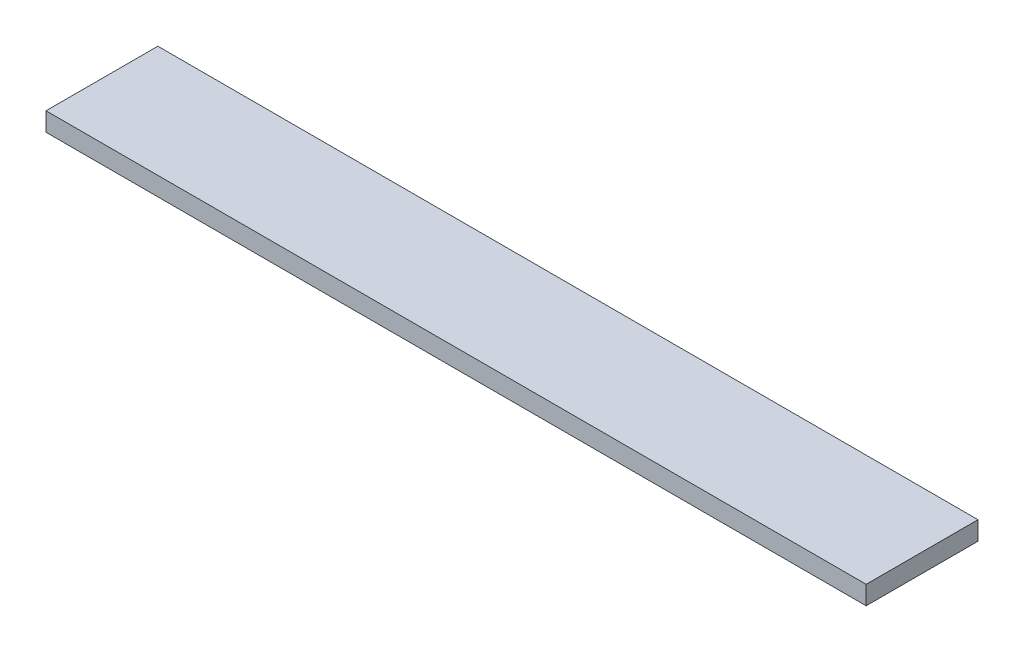
ISO-10303-21;
HEADER;
FILE_DESCRIPTION(('STEP AP214'),'2;1');
FILE_NAME('part.step','',(''),(''),'','','');
FILE_SCHEMA(('AUTOMOTIVE_DESIGN { 1 0 10303 214 1 1 1 1 }'));
ENDSEC;
DATA;
#1=APPLICATION_CONTEXT('core data for automotive mechanical design processes');
#2=APPLICATION_PROTOCOL_DEFINITION('international standard','automotive_design',2000,#1);
#3=PRODUCT_CONTEXT('',#1,'mechanical');
#4=PRODUCT('Part','Part','',(#3));
#5=PRODUCT_RELATED_PRODUCT_CATEGORY('part','',(#4));
#6=PRODUCT_DEFINITION_FORMATION('','',#4);
#7=PRODUCT_DEFINITION_CONTEXT('part definition',#1,'design');
#8=PRODUCT_DEFINITION('design','',#6,#7);
#9=PRODUCT_DEFINITION_SHAPE('','',#8);
#10=(LENGTH_UNIT() NAMED_UNIT(*) SI_UNIT(.MILLI.,.METRE.));
#11=(NAMED_UNIT(*) PLANE_ANGLE_UNIT() SI_UNIT($,.RADIAN.));
#12=(NAMED_UNIT(*) SI_UNIT($,.STERADIAN.) SOLID_ANGLE_UNIT());
#13=UNCERTAINTY_MEASURE_WITH_UNIT(LENGTH_MEASURE(1.E-05),#10,'distance_accuracy_value','');
#14=(GEOMETRIC_REPRESENTATION_CONTEXT(3) GLOBAL_UNCERTAINTY_ASSIGNED_CONTEXT((#13)) GLOBAL_UNIT_ASSIGNED_CONTEXT((#10,
#11,#12)) REPRESENTATION_CONTEXT('',''));
#15=CARTESIAN_POINT('',(0.,0.,0.));
#16=DIRECTION('',(0.,0.,1.));
#17=DIRECTION('',(1.,0.,0.));
#18=AXIS2_PLACEMENT_3D('',#15,#16,#17);
#19=CARTESIAN_POINT('',(0.,3.175,0.));
#20=DIRECTION('',(1.,0.,0.));
#21=DIRECTION('',(0.,0.,-1.));
#22=AXIS2_PLACEMENT_3D('',#19,#20,#21);
#23=PLANE('',#22);
#24=DIRECTION('',(0.,0.,1.));
#25=VECTOR('',#24,1.);
#26=CARTESIAN_POINT('',(0.,0.,0.));
#27=LINE('',#26,#25);
#28=CARTESIAN_POINT('',(0.,0.,0.));
#29=VERTEX_POINT('',#28);
#30=CARTESIAN_POINT('',(0.,0.,19.05));
#31=VERTEX_POINT('',#30);
#32=EDGE_CURVE('E96',#29,#31,#27,.T.);
#33=ORIENTED_EDGE('',*,*,#32,.T.);
#34=DIRECTION('',(0.,-1.,0.));
#35=VECTOR('',#34,1.);
#36=CARTESIAN_POINT('',(0.,3.175,19.05));
#37=LINE('',#36,#35);
#38=CARTESIAN_POINT('',(0.,3.175,19.05));
#39=VERTEX_POINT('',#38);
#40=EDGE_CURVE('E11',#39,#31,#37,.T.);
#41=ORIENTED_EDGE('',*,*,#40,.F.);
#42=DIRECTION('',(0.,0.,1.));
#43=VECTOR('',#42,1.);
#44=CARTESIAN_POINT('',(0.,3.175,0.));
#45=LINE('',#44,#43);
#46=CARTESIAN_POINT('',(0.,3.175,0.));
#47=VERTEX_POINT('',#46);
#48=EDGE_CURVE('E84',#47,#39,#45,.T.);
#49=ORIENTED_EDGE('',*,*,#48,.F.);
#50=DIRECTION('',(0.,-1.,0.));
#51=VECTOR('',#50,1.);
#52=CARTESIAN_POINT('',(0.,3.175,0.));
#53=LINE('',#52,#51);
#54=EDGE_CURVE('E92',#47,#29,#53,.T.);
#55=ORIENTED_EDGE('',*,*,#54,.T.);
#56=EDGE_LOOP('',(#33,#41,#49,#55));
#57=FACE_BOUND('',#56,.T.);
#58=ADVANCED_FACE('F33',(#57),#23,.F.);
#59=CARTESIAN_POINT('',(0.,3.175,19.05));
#60=DIRECTION('',(0.,0.,-1.));
#61=DIRECTION('',(-1.,0.,0.));
#62=AXIS2_PLACEMENT_3D('',#59,#60,#61);
#63=PLANE('',#62);
#64=DIRECTION('',(1.,0.,0.));
#65=VECTOR('',#64,1.);
#66=CARTESIAN_POINT('',(0.,0.,19.05));
#67=LINE('',#66,#65);
#68=CARTESIAN_POINT('',(139.7,0.,19.05));
#69=VERTEX_POINT('',#68);
#70=EDGE_CURVE('E88',#31,#69,#67,.T.);
#71=ORIENTED_EDGE('',*,*,#70,.T.);
#72=DIRECTION('',(0.,-1.,0.));
#73=VECTOR('',#72,1.);
#74=CARTESIAN_POINT('',(139.7,3.175,19.05));
#75=LINE('',#74,#73);
#76=CARTESIAN_POINT('',(139.7,3.175,19.05));
#77=VERTEX_POINT('',#76);
#78=EDGE_CURVE('E41',#77,#69,#75,.T.);
#79=ORIENTED_EDGE('',*,*,#78,.F.);
#80=DIRECTION('',(1.,0.,0.));
#81=VECTOR('',#80,1.);
#82=CARTESIAN_POINT('',(0.,3.175,19.05));
#83=LINE('',#82,#81);
#84=EDGE_CURVE('E79',#39,#77,#83,.T.);
#85=ORIENTED_EDGE('',*,*,#84,.F.);
#86=ORIENTED_EDGE('',*,*,#40,.T.);
#87=EDGE_LOOP('',(#71,#79,#85,#86));
#88=FACE_BOUND('',#87,.T.);
#89=ADVANCED_FACE('F87',(#88),#63,.F.);
#90=CARTESIAN_POINT('',(139.7,3.175,0.));
#91=DIRECTION('',(-1.,0.,0.));
#92=DIRECTION('',(0.,0.,1.));
#93=AXIS2_PLACEMENT_3D('',#90,#91,#92);
#94=PLANE('',#93);
#95=DIRECTION('',(0.,0.,-1.));
#96=VECTOR('',#95,1.);
#97=CARTESIAN_POINT('',(139.7,0.,0.));
#98=LINE('',#97,#96);
#99=CARTESIAN_POINT('',(139.7,0.,0.));
#100=VERTEX_POINT('',#99);
#101=EDGE_CURVE('E66',#69,#100,#98,.T.);
#102=ORIENTED_EDGE('',*,*,#101,.T.);
#103=DIRECTION('',(0.,-1.,0.));
#104=VECTOR('',#103,1.);
#105=CARTESIAN_POINT('',(139.7,3.175,0.));
#106=LINE('',#105,#104);
#107=CARTESIAN_POINT('',(139.7,3.175,0.));
#108=VERTEX_POINT('',#107);
#109=EDGE_CURVE('E89',#108,#100,#106,.T.);
#110=ORIENTED_EDGE('',*,*,#109,.F.);
#111=DIRECTION('',(0.,0.,-1.));
#112=VECTOR('',#111,1.);
#113=CARTESIAN_POINT('',(139.7,3.175,0.));
#114=LINE('',#113,#112);
#115=EDGE_CURVE('E82',#77,#108,#114,.T.);
#116=ORIENTED_EDGE('',*,*,#115,.F.);
#117=ORIENTED_EDGE('',*,*,#78,.T.);
#118=EDGE_LOOP('',(#102,#110,#116,#117));
#119=FACE_BOUND('',#118,.T.);
#120=ADVANCED_FACE('F90',(#119),#94,.F.);
#121=CARTESIAN_POINT('',(0.,3.175,0.));
#122=DIRECTION('',(0.,0.,1.));
#123=DIRECTION('',(1.,0.,0.));
#124=AXIS2_PLACEMENT_3D('',#121,#122,#123);
#125=PLANE('',#124);
#126=DIRECTION('',(-1.,0.,0.));
#127=VECTOR('',#126,1.);
#128=CARTESIAN_POINT('',(0.,0.,0.));
#129=LINE('',#128,#127);
#130=EDGE_CURVE('E72',#100,#29,#129,.T.);
#131=ORIENTED_EDGE('',*,*,#130,.T.);
#132=ORIENTED_EDGE('',*,*,#54,.F.);
#133=DIRECTION('',(-1.,0.,0.));
#134=VECTOR('',#133,1.);
#135=CARTESIAN_POINT('',(0.,3.175,0.));
#136=LINE('',#135,#134);
#137=EDGE_CURVE('E49',#108,#47,#136,.T.);
#138=ORIENTED_EDGE('',*,*,#137,.F.);
#139=ORIENTED_EDGE('',*,*,#109,.T.);
#140=EDGE_LOOP('',(#131,#132,#138,#139));
#141=FACE_BOUND('',#140,.T.);
#142=ADVANCED_FACE('F103',(#141),#125,.F.);
#143=CARTESIAN_POINT('',(0.,3.175,0.));
#144=DIRECTION('',(0.,1.,0.));
#145=DIRECTION('',(0.,0.,1.));
#146=AXIS2_PLACEMENT_3D('',#143,#144,#145);
#147=PLANE('',#146);
#148=ORIENTED_EDGE('',*,*,#48,.T.);
#149=ORIENTED_EDGE('',*,*,#84,.T.);
#150=ORIENTED_EDGE('',*,*,#115,.T.);
#151=ORIENTED_EDGE('',*,*,#137,.T.);
#152=EDGE_LOOP('',(#148,#149,#150,#151));
#153=FACE_BOUND('',#152,.T.);
#154=ADVANCED_FACE('F80',(#153),#147,.T.);
#155=CARTESIAN_POINT('',(0.,0.,0.));
#156=DIRECTION('',(0.,1.,0.));
#157=DIRECTION('',(0.,0.,1.));
#158=AXIS2_PLACEMENT_3D('',#155,#156,#157);
#159=PLANE('',#158);
#160=ORIENTED_EDGE('',*,*,#32,.F.);
#161=ORIENTED_EDGE('',*,*,#130,.F.);
#162=ORIENTED_EDGE('',*,*,#101,.F.);
#163=ORIENTED_EDGE('',*,*,#70,.F.);
#164=EDGE_LOOP('',(#160,#161,#162,#163));
#165=FACE_BOUND('',#164,.T.);
#166=ADVANCED_FACE('F106',(#165),#159,.F.);
#167=CLOSED_SHELL('',(#58,#89,#120,#142,#154,#166));
#168=MANIFOLD_SOLID_BREP('B2',#167);
#169=ADVANCED_BREP_SHAPE_REPRESENTATION('',(#18,#168),#14);
#170=SHAPE_DEFINITION_REPRESENTATION(#9,#169);
ENDSEC;
END-ISO-10303-21;
